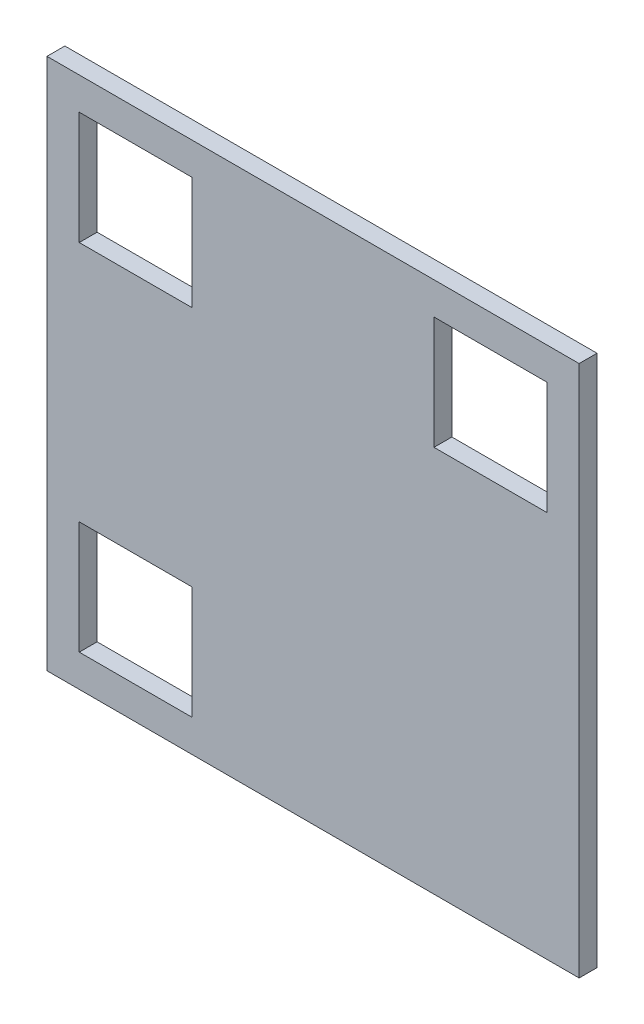
ISO-10303-21;
HEADER;
FILE_DESCRIPTION(('STEP AP214'),'2;1');
FILE_NAME('part.step','',(''),(''),'','','');
FILE_SCHEMA(('AUTOMOTIVE_DESIGN { 1 0 10303 214 1 1 1 1 }'));
ENDSEC;
DATA;
#1=APPLICATION_CONTEXT('core data for automotive mechanical design processes');
#2=APPLICATION_PROTOCOL_DEFINITION('international standard','automotive_design',2000,#1);
#3=PRODUCT_CONTEXT('',#1,'mechanical');
#4=PRODUCT('Part','Part','',(#3));
#5=PRODUCT_RELATED_PRODUCT_CATEGORY('part','',(#4));
#6=PRODUCT_DEFINITION_FORMATION('','',#4);
#7=PRODUCT_DEFINITION_CONTEXT('part definition',#1,'design');
#8=PRODUCT_DEFINITION('design','',#6,#7);
#9=PRODUCT_DEFINITION_SHAPE('','',#8);
#10=(LENGTH_UNIT() NAMED_UNIT(*) SI_UNIT(.MILLI.,.METRE.));
#11=(NAMED_UNIT(*) PLANE_ANGLE_UNIT() SI_UNIT($,.RADIAN.));
#12=(NAMED_UNIT(*) SI_UNIT($,.STERADIAN.) SOLID_ANGLE_UNIT());
#13=UNCERTAINTY_MEASURE_WITH_UNIT(LENGTH_MEASURE(1.E-05),#10,'distance_accuracy_value','');
#14=(GEOMETRIC_REPRESENTATION_CONTEXT(3) GLOBAL_UNCERTAINTY_ASSIGNED_CONTEXT((#13)) GLOBAL_UNIT_ASSIGNED_CONTEXT((#10,
#11,#12)) REPRESENTATION_CONTEXT('',''));
#15=CARTESIAN_POINT('',(0.,0.,0.));
#16=DIRECTION('',(0.,0.,1.));
#17=DIRECTION('',(1.,0.,0.));
#18=AXIS2_PLACEMENT_3D('',#15,#16,#17);
#19=CARTESIAN_POINT('',(2.38012320757309,12.2016563993689,0.15));
#20=DIRECTION('',(0.,-1.,0.));
#21=DIRECTION('',(0.,0.,-1.));
#22=AXIS2_PLACEMENT_3D('',#19,#20,#21);
#23=PLANE('',#22);
#24=DIRECTION('',(1.,0.,0.));
#25=VECTOR('',#24,1.);
#26=CARTESIAN_POINT('',(3.07432580978191,12.2016563993689,0.15));
#27=LINE('',#26,#25);
#28=CARTESIAN_POINT('',(2.38012320757309,12.2016563993689,0.15));
#29=VERTEX_POINT('',#28);
#30=CARTESIAN_POINT('',(3.07432580978191,12.2016563993689,0.15));
#31=VERTEX_POINT('',#30);
#32=EDGE_CURVE('E259',#29,#31,#27,.T.);
#33=ORIENTED_EDGE('',*,*,#32,.T.);
#34=DIRECTION('',(0.,0.,1.));
#35=VECTOR('',#34,1.);
#36=CARTESIAN_POINT('',(3.07432580978191,12.2016563993689,0.15));
#37=LINE('',#36,#35);
#38=CARTESIAN_POINT('',(3.07432580978191,12.2016563993689,0.26));
#39=VERTEX_POINT('',#38);
#40=EDGE_CURVE('E192',#31,#39,#37,.T.);
#41=ORIENTED_EDGE('',*,*,#40,.T.);
#42=DIRECTION('',(1.,0.,0.));
#43=VECTOR('',#42,1.);
#44=CARTESIAN_POINT('',(3.07432580978191,12.2016563993689,0.26));
#45=LINE('',#44,#43);
#46=CARTESIAN_POINT('',(2.38012320757309,12.2016563993689,0.26));
#47=VERTEX_POINT('',#46);
#48=EDGE_CURVE('E199',#47,#39,#45,.T.);
#49=ORIENTED_EDGE('',*,*,#48,.F.);
#50=DIRECTION('',(0.,0.,1.));
#51=VECTOR('',#50,1.);
#52=CARTESIAN_POINT('',(2.38012320757309,12.2016563993689,0.15));
#53=LINE('',#52,#51);
#54=EDGE_CURVE('E20',#29,#47,#53,.T.);
#55=ORIENTED_EDGE('',*,*,#54,.F.);
#56=EDGE_LOOP('',(#33,#41,#49,#55));
#57=FACE_BOUND('',#56,.T.);
#58=ADVANCED_FACE('F16',(#57),#23,.T.);
#59=CARTESIAN_POINT('',(0.198343600631091,10.0198767924269,0.15));
#60=DIRECTION('',(0.,-1.,0.));
#61=DIRECTION('',(0.,0.,-1.));
#62=AXIS2_PLACEMENT_3D('',#59,#60,#61);
#63=PLANE('',#62);
#64=DIRECTION('',(1.,0.,0.));
#65=VECTOR('',#64,1.);
#66=CARTESIAN_POINT('',(0.892546202839908,10.0198767924269,0.15));
#67=LINE('',#66,#65);
#68=CARTESIAN_POINT('',(0.198343600631091,10.0198767924269,0.15));
#69=VERTEX_POINT('',#68);
#70=CARTESIAN_POINT('',(0.892546202839908,10.0198767924269,0.15));
#71=VERTEX_POINT('',#70);
#72=EDGE_CURVE('E277',#69,#71,#67,.T.);
#73=ORIENTED_EDGE('',*,*,#72,.T.);
#74=DIRECTION('',(0.,0.,1.));
#75=VECTOR('',#74,1.);
#76=CARTESIAN_POINT('',(0.892546202839908,10.0198767924269,0.15));
#77=LINE('',#76,#75);
#78=CARTESIAN_POINT('',(0.892546202839908,10.0198767924269,0.26));
#79=VERTEX_POINT('',#78);
#80=EDGE_CURVE('E11',#71,#79,#77,.T.);
#81=ORIENTED_EDGE('',*,*,#80,.T.);
#82=DIRECTION('',(1.,0.,0.));
#83=VECTOR('',#82,1.);
#84=CARTESIAN_POINT('',(0.892546202839908,10.0198767924269,0.26));
#85=LINE('',#84,#83);
#86=CARTESIAN_POINT('',(0.198343600631091,10.0198767924269,0.26));
#87=VERTEX_POINT('',#86);
#88=EDGE_CURVE('E211',#87,#79,#85,.T.);
#89=ORIENTED_EDGE('',*,*,#88,.F.);
#90=DIRECTION('',(0.,0.,1.));
#91=VECTOR('',#90,1.);
#92=CARTESIAN_POINT('',(0.198343600631091,10.0198767924269,0.15));
#93=LINE('',#92,#91);
#94=EDGE_CURVE('E27',#69,#87,#93,.T.);
#95=ORIENTED_EDGE('',*,*,#94,.F.);
#96=EDGE_LOOP('',(#73,#81,#89,#95));
#97=FACE_BOUND('',#96,.T.);
#98=ADVANCED_FACE('F383',(#97),#63,.T.);
#99=CARTESIAN_POINT('',(0.892546202839908,10.0198767924269,0.15));
#100=DIRECTION('',(-1.,0.,0.));
#101=DIRECTION('',(0.,0.,1.));
#102=AXIS2_PLACEMENT_3D('',#99,#100,#101);
#103=PLANE('',#102);
#104=DIRECTION('',(0.,-1.,0.));
#105=VECTOR('',#104,1.);
#106=CARTESIAN_POINT('',(0.892546202839908,9.32567419021809,0.15));
#107=LINE('',#106,#105);
#108=CARTESIAN_POINT('',(0.892546202839908,9.32567419021809,0.15));
#109=VERTEX_POINT('',#108);
#110=EDGE_CURVE('E263',#71,#109,#107,.T.);
#111=ORIENTED_EDGE('',*,*,#110,.T.);
#112=DIRECTION('',(0.,0.,1.));
#113=VECTOR('',#112,1.);
#114=CARTESIAN_POINT('',(0.892546202839908,9.32567419021809,0.15));
#115=LINE('',#114,#113);
#116=CARTESIAN_POINT('',(0.892546202839908,9.32567419021809,0.26));
#117=VERTEX_POINT('',#116);
#118=EDGE_CURVE('E191',#109,#117,#115,.T.);
#119=ORIENTED_EDGE('',*,*,#118,.T.);
#120=DIRECTION('',(0.,-1.,0.));
#121=VECTOR('',#120,1.);
#122=CARTESIAN_POINT('',(0.892546202839908,9.32567419021809,0.26));
#123=LINE('',#122,#121);
#124=EDGE_CURVE('E203',#79,#117,#123,.T.);
#125=ORIENTED_EDGE('',*,*,#124,.F.);
#126=ORIENTED_EDGE('',*,*,#80,.F.);
#127=EDGE_LOOP('',(#111,#119,#125,#126));
#128=FACE_BOUND('',#127,.T.);
#129=ADVANCED_FACE('F389',(#128),#103,.T.);
#130=CARTESIAN_POINT('',(0.198343600631091,11.5074537971601,0.15));
#131=DIRECTION('',(1.,0.,0.));
#132=DIRECTION('',(0.,1.,0.));
#133=AXIS2_PLACEMENT_3D('',#130,#131,#132);
#134=PLANE('',#133);
#135=DIRECTION('',(0.,1.,0.));
#136=VECTOR('',#135,1.);
#137=CARTESIAN_POINT('',(0.198343600631091,12.2016563993689,0.15));
#138=LINE('',#137,#136);
#139=CARTESIAN_POINT('',(0.198343600631091,11.5074537971601,0.15));
#140=VERTEX_POINT('',#139);
#141=CARTESIAN_POINT('',(0.198343600631091,12.2016563993689,0.15));
#142=VERTEX_POINT('',#141);
#143=EDGE_CURVE('E269',#140,#142,#138,.T.);
#144=ORIENTED_EDGE('',*,*,#143,.T.);
#145=DIRECTION('',(0.,0.,1.));
#146=VECTOR('',#145,1.);
#147=CARTESIAN_POINT('',(0.198343600631091,12.2016563993689,0.15));
#148=LINE('',#147,#146);
#149=CARTESIAN_POINT('',(0.198343600631091,12.2016563993689,0.26));
#150=VERTEX_POINT('',#149);
#151=EDGE_CURVE('E244',#142,#150,#148,.T.);
#152=ORIENTED_EDGE('',*,*,#151,.T.);
#153=DIRECTION('',(0.,1.,0.));
#154=VECTOR('',#153,1.);
#155=CARTESIAN_POINT('',(0.198343600631091,12.2016563993689,0.26));
#156=LINE('',#155,#154);
#157=CARTESIAN_POINT('',(0.198343600631091,11.5074537971601,0.26));
#158=VERTEX_POINT('',#157);
#159=EDGE_CURVE('E253',#158,#150,#156,.T.);
#160=ORIENTED_EDGE('',*,*,#159,.F.);
#161=DIRECTION('',(0.,0.,1.));
#162=VECTOR('',#161,1.);
#163=CARTESIAN_POINT('',(0.198343600631091,11.5074537971601,0.15));
#164=LINE('',#163,#162);
#165=EDGE_CURVE('E216',#140,#158,#164,.T.);
#166=ORIENTED_EDGE('',*,*,#165,.F.);
#167=EDGE_LOOP('',(#144,#152,#160,#166));
#168=FACE_BOUND('',#167,.T.);
#169=ADVANCED_FACE('F751',(#168),#134,.T.);
#170=CARTESIAN_POINT('',(0.198343600631091,9.32567419021809,0.15));
#171=DIRECTION('',(1.,0.,0.));
#172=DIRECTION('',(0.,1.,0.));
#173=AXIS2_PLACEMENT_3D('',#170,#171,#172);
#174=PLANE('',#173);
#175=DIRECTION('',(0.,1.,0.));
#176=VECTOR('',#175,1.);
#177=CARTESIAN_POINT('',(0.198343600631091,10.0198767924269,0.15));
#178=LINE('',#177,#176);
#179=CARTESIAN_POINT('',(0.198343600631091,9.32567419021809,0.15));
#180=VERTEX_POINT('',#179);
#181=EDGE_CURVE('E274',#180,#69,#178,.T.);
#182=ORIENTED_EDGE('',*,*,#181,.T.);
#183=ORIENTED_EDGE('',*,*,#94,.T.);
#184=DIRECTION('',(0.,1.,0.));
#185=VECTOR('',#184,1.);
#186=CARTESIAN_POINT('',(0.198343600631091,10.0198767924269,0.26));
#187=LINE('',#186,#185);
#188=CARTESIAN_POINT('',(0.198343600631091,9.32567419021809,0.26));
#189=VERTEX_POINT('',#188);
#190=EDGE_CURVE('E194',#189,#87,#187,.T.);
#191=ORIENTED_EDGE('',*,*,#190,.F.);
#192=DIRECTION('',(0.,0.,1.));
#193=VECTOR('',#192,1.);
#194=CARTESIAN_POINT('',(0.198343600631091,9.32567419021809,0.15));
#195=LINE('',#194,#193);
#196=EDGE_CURVE('E182',#180,#189,#195,.T.);
#197=ORIENTED_EDGE('',*,*,#196,.F.);
#198=EDGE_LOOP('',(#182,#183,#191,#197));
#199=FACE_BOUND('',#198,.T.);
#200=ADVANCED_FACE('F195',(#199),#174,.T.);
#201=CARTESIAN_POINT('',(0.892546202839908,9.32567419021809,0.15));
#202=DIRECTION('',(0.,1.,0.));
#203=DIRECTION('',(1.,0.,0.));
#204=AXIS2_PLACEMENT_3D('',#201,#202,#203);
#205=PLANE('',#204);
#206=DIRECTION('',(-1.,0.,0.));
#207=VECTOR('',#206,1.);
#208=CARTESIAN_POINT('',(0.198343600631091,9.32567419021809,0.15));
#209=LINE('',#208,#207);
#210=EDGE_CURVE('E188',#109,#180,#209,.T.);
#211=ORIENTED_EDGE('',*,*,#210,.T.);
#212=ORIENTED_EDGE('',*,*,#196,.T.);
#213=DIRECTION('',(-1.,0.,0.));
#214=VECTOR('',#213,1.);
#215=CARTESIAN_POINT('',(0.198343600631091,9.32567419021809,0.26));
#216=LINE('',#215,#214);
#217=EDGE_CURVE('E185',#117,#189,#216,.T.);
#218=ORIENTED_EDGE('',*,*,#217,.F.);
#219=ORIENTED_EDGE('',*,*,#118,.F.);
#220=EDGE_LOOP('',(#211,#212,#218,#219));
#221=FACE_BOUND('',#220,.T.);
#222=ADVANCED_FACE('F183',(#221),#205,.T.);
#223=CARTESIAN_POINT('',(3.07432580978191,12.2016563993689,0.15));
#224=DIRECTION('',(-1.,0.,0.));
#225=DIRECTION('',(0.,0.,1.));
#226=AXIS2_PLACEMENT_3D('',#223,#224,#225);
#227=PLANE('',#226);
#228=DIRECTION('',(0.,-1.,0.));
#229=VECTOR('',#228,1.);
#230=CARTESIAN_POINT('',(3.07432580978191,11.5074537971601,0.15));
#231=LINE('',#230,#229);
#232=CARTESIAN_POINT('',(3.07432580978191,11.5074537971601,0.15));
#233=VERTEX_POINT('',#232);
#234=EDGE_CURVE('E251',#31,#233,#231,.T.);
#235=ORIENTED_EDGE('',*,*,#234,.T.);
#236=DIRECTION('',(0.,0.,1.));
#237=VECTOR('',#236,1.);
#238=CARTESIAN_POINT('',(3.07432580978191,11.5074537971601,0.15));
#239=LINE('',#238,#237);
#240=CARTESIAN_POINT('',(3.07432580978191,11.5074537971601,0.26));
#241=VERTEX_POINT('',#240);
#242=EDGE_CURVE('E41',#233,#241,#239,.T.);
#243=ORIENTED_EDGE('',*,*,#242,.T.);
#244=DIRECTION('',(0.,-1.,0.));
#245=VECTOR('',#244,1.);
#246=CARTESIAN_POINT('',(3.07432580978191,11.5074537971601,0.26));
#247=LINE('',#246,#245);
#248=EDGE_CURVE('E291',#39,#241,#247,.T.);
#249=ORIENTED_EDGE('',*,*,#248,.F.);
#250=ORIENTED_EDGE('',*,*,#40,.F.);
#251=EDGE_LOOP('',(#235,#243,#249,#250));
#252=FACE_BOUND('',#251,.T.);
#253=ADVANCED_FACE('F18',(#252),#227,.T.);
#254=CARTESIAN_POINT('',(0.892546202839908,12.2016563993689,0.15));
#255=DIRECTION('',(-1.,0.,0.));
#256=DIRECTION('',(0.,0.,1.));
#257=AXIS2_PLACEMENT_3D('',#254,#255,#256);
#258=PLANE('',#257);
#259=DIRECTION('',(0.,-1.,0.));
#260=VECTOR('',#259,1.);
#261=CARTESIAN_POINT('',(0.892546202839908,11.5074537971601,0.15));
#262=LINE('',#261,#260);
#263=CARTESIAN_POINT('',(0.892546202839908,12.2016563993689,0.15));
#264=VERTEX_POINT('',#263);
#265=CARTESIAN_POINT('',(0.892546202839908,11.5074537971601,0.15));
#266=VERTEX_POINT('',#265);
#267=EDGE_CURVE('E268',#264,#266,#262,.T.);
#268=ORIENTED_EDGE('',*,*,#267,.T.);
#269=DIRECTION('',(0.,0.,1.));
#270=VECTOR('',#269,1.);
#271=CARTESIAN_POINT('',(0.892546202839908,11.5074537971601,0.15));
#272=LINE('',#271,#270);
#273=CARTESIAN_POINT('',(0.892546202839908,11.5074537971601,0.26));
#274=VERTEX_POINT('',#273);
#275=EDGE_CURVE('E214',#266,#274,#272,.T.);
#276=ORIENTED_EDGE('',*,*,#275,.T.);
#277=DIRECTION('',(0.,-1.,0.));
#278=VECTOR('',#277,1.);
#279=CARTESIAN_POINT('',(0.892546202839908,11.5074537971601,0.26));
#280=LINE('',#279,#278);
#281=CARTESIAN_POINT('',(0.892546202839908,12.2016563993689,0.26));
#282=VERTEX_POINT('',#281);
#283=EDGE_CURVE('E228',#282,#274,#280,.T.);
#284=ORIENTED_EDGE('',*,*,#283,.F.);
#285=DIRECTION('',(0.,0.,1.));
#286=VECTOR('',#285,1.);
#287=CARTESIAN_POINT('',(0.892546202839908,12.2016563993689,0.15));
#288=LINE('',#287,#286);
#289=EDGE_CURVE('E247',#264,#282,#288,.T.);
#290=ORIENTED_EDGE('',*,*,#289,.F.);
#291=EDGE_LOOP('',(#268,#276,#284,#290));
#292=FACE_BOUND('',#291,.T.);
#293=ADVANCED_FACE('F774',(#292),#258,.T.);
#294=CARTESIAN_POINT('',(3.272669410413,9.127330589587,0.15));
#295=DIRECTION('',(1.,0.,0.));
#296=DIRECTION('',(0.,1.,0.));
#297=AXIS2_PLACEMENT_3D('',#294,#295,#296);
#298=PLANE('',#297);
#299=DIRECTION('',(0.,-1.,0.));
#300=VECTOR('',#299,1.);
#301=CARTESIAN_POINT('',(3.272669410413,12.4,0.15));
#302=LINE('',#301,#300);
#303=CARTESIAN_POINT('',(3.272669410413,12.4,0.15));
#304=VERTEX_POINT('',#303);
#305=CARTESIAN_POINT('',(3.272669410413,9.127330589587,0.15));
#306=VERTEX_POINT('',#305);
#307=EDGE_CURVE('E324',#304,#306,#302,.T.);
#308=ORIENTED_EDGE('',*,*,#307,.F.);
#309=DIRECTION('',(0.,0.,1.));
#310=VECTOR('',#309,1.);
#311=CARTESIAN_POINT('',(3.272669410413,12.4,0.15));
#312=LINE('',#311,#310);
#313=CARTESIAN_POINT('',(3.272669410413,12.4,0.26));
#314=VERTEX_POINT('',#313);
#315=EDGE_CURVE('E120',#304,#314,#312,.T.);
#316=ORIENTED_EDGE('',*,*,#315,.T.);
#317=DIRECTION('',(0.,1.,0.));
#318=VECTOR('',#317,1.);
#319=CARTESIAN_POINT('',(3.272669410413,12.4,0.26));
#320=LINE('',#319,#318);
#321=CARTESIAN_POINT('',(3.272669410413,9.127330589587,0.26));
#322=VERTEX_POINT('',#321);
#323=EDGE_CURVE('E239',#322,#314,#320,.T.);
#324=ORIENTED_EDGE('',*,*,#323,.F.);
#325=DIRECTION('',(0.,0.,1.));
#326=VECTOR('',#325,1.);
#327=CARTESIAN_POINT('',(3.272669410413,9.127330589587,0.15));
#328=LINE('',#327,#326);
#329=EDGE_CURVE('E219',#306,#322,#328,.T.);
#330=ORIENTED_EDGE('',*,*,#329,.F.);
#331=EDGE_LOOP('',(#308,#316,#324,#330));
#332=FACE_BOUND('',#331,.T.);
#333=ADVANCED_FACE('F360',(#332),#298,.T.);
#334=CARTESIAN_POINT('',(0.,12.4,0.15));
#335=DIRECTION('',(-1.,0.,0.));
#336=DIRECTION('',(0.,0.,1.));
#337=AXIS2_PLACEMENT_3D('',#334,#335,#336);
#338=PLANE('',#337);
#339=DIRECTION('',(0.,1.,0.));
#340=VECTOR('',#339,1.);
#341=CARTESIAN_POINT('',(0.,9.127330589587,0.15));
#342=LINE('',#341,#340);
#343=CARTESIAN_POINT('',(0.,9.127330589587,0.15));
#344=VERTEX_POINT('',#343);
#345=CARTESIAN_POINT('',(0.,12.4,0.15));
#346=VERTEX_POINT('',#345);
#347=EDGE_CURVE('E325',#344,#346,#342,.T.);
#348=ORIENTED_EDGE('',*,*,#347,.F.);
#349=DIRECTION('',(0.,0.,1.));
#350=VECTOR('',#349,1.);
#351=CARTESIAN_POINT('',(0.,9.127330589587,0.15));
#352=LINE('',#351,#350);
#353=CARTESIAN_POINT('',(0.,9.127330589587,0.26));
#354=VERTEX_POINT('',#353);
#355=EDGE_CURVE('E222',#344,#354,#352,.T.);
#356=ORIENTED_EDGE('',*,*,#355,.T.);
#357=DIRECTION('',(0.,-1.,0.));
#358=VECTOR('',#357,1.);
#359=CARTESIAN_POINT('',(0.,9.127330589587,0.26));
#360=LINE('',#359,#358);
#361=CARTESIAN_POINT('',(0.,12.4,0.26));
#362=VERTEX_POINT('',#361);
#363=EDGE_CURVE('E238',#362,#354,#360,.T.);
#364=ORIENTED_EDGE('',*,*,#363,.F.);
#365=DIRECTION('',(0.,0.,1.));
#366=VECTOR('',#365,1.);
#367=CARTESIAN_POINT('',(0.,12.4,0.15));
#368=LINE('',#367,#366);
#369=EDGE_CURVE('E130',#346,#362,#368,.T.);
#370=ORIENTED_EDGE('',*,*,#369,.F.);
#371=EDGE_LOOP('',(#348,#356,#364,#370));
#372=FACE_BOUND('',#371,.T.);
#373=ADVANCED_FACE('F365',(#372),#338,.T.);
#374=CARTESIAN_POINT('',(3.272669410413,12.4,0.15));
#375=DIRECTION('',(0.,1.,0.));
#376=DIRECTION('',(1.,0.,0.));
#377=AXIS2_PLACEMENT_3D('',#374,#375,#376);
#378=PLANE('',#377);
#379=DIRECTION('',(1.,0.,0.));
#380=VECTOR('',#379,1.);
#381=CARTESIAN_POINT('',(0.,12.4,0.15));
#382=LINE('',#381,#380);
#383=EDGE_CURVE('E320',#346,#304,#382,.T.);
#384=ORIENTED_EDGE('',*,*,#383,.F.);
#385=ORIENTED_EDGE('',*,*,#369,.T.);
#386=DIRECTION('',(-1.,0.,0.));
#387=VECTOR('',#386,1.);
#388=CARTESIAN_POINT('',(0.,12.4,0.26));
#389=LINE('',#388,#387);
#390=EDGE_CURVE('E234',#314,#362,#389,.T.);
#391=ORIENTED_EDGE('',*,*,#390,.F.);
#392=ORIENTED_EDGE('',*,*,#315,.F.);
#393=EDGE_LOOP('',(#384,#385,#391,#392));
#394=FACE_BOUND('',#393,.T.);
#395=ADVANCED_FACE('F367',(#394),#378,.T.);
#396=CARTESIAN_POINT('',(0.892546202839908,11.5074537971601,0.15));
#397=DIRECTION('',(0.,1.,0.));
#398=DIRECTION('',(1.,0.,0.));
#399=AXIS2_PLACEMENT_3D('',#396,#397,#398);
#400=PLANE('',#399);
#401=DIRECTION('',(-1.,0.,0.));
#402=VECTOR('',#401,1.);
#403=CARTESIAN_POINT('',(0.198343600631091,11.5074537971601,0.15));
#404=LINE('',#403,#402);
#405=EDGE_CURVE('E264',#266,#140,#404,.T.);
#406=ORIENTED_EDGE('',*,*,#405,.T.);
#407=ORIENTED_EDGE('',*,*,#165,.T.);
#408=DIRECTION('',(-1.,0.,0.));
#409=VECTOR('',#408,1.);
#410=CARTESIAN_POINT('',(0.198343600631091,11.5074537971601,0.26));
#411=LINE('',#410,#409);
#412=EDGE_CURVE('E232',#274,#158,#411,.T.);
#413=ORIENTED_EDGE('',*,*,#412,.F.);
#414=ORIENTED_EDGE('',*,*,#275,.F.);
#415=EDGE_LOOP('',(#406,#407,#413,#414));
#416=FACE_BOUND('',#415,.T.);
#417=ADVANCED_FACE('F369',(#416),#400,.T.);
#418=CARTESIAN_POINT('',(3.07432580978191,11.5074537971601,0.15));
#419=DIRECTION('',(0.,1.,0.));
#420=DIRECTION('',(1.,0.,0.));
#421=AXIS2_PLACEMENT_3D('',#418,#419,#420);
#422=PLANE('',#421);
#423=DIRECTION('',(-1.,0.,0.));
#424=VECTOR('',#423,1.);
#425=CARTESIAN_POINT('',(2.38012320757309,11.5074537971601,0.15));
#426=LINE('',#425,#424);
#427=CARTESIAN_POINT('',(2.38012320757309,11.5074537971601,0.15));
#428=VERTEX_POINT('',#427);
#429=EDGE_CURVE('E248',#233,#428,#426,.T.);
#430=ORIENTED_EDGE('',*,*,#429,.T.);
#431=DIRECTION('',(0.,0.,1.));
#432=VECTOR('',#431,1.);
#433=CARTESIAN_POINT('',(2.38012320757309,11.5074537971601,0.15));
#434=LINE('',#433,#432);
#435=CARTESIAN_POINT('',(2.38012320757309,11.5074537971601,0.26));
#436=VERTEX_POINT('',#435);
#437=EDGE_CURVE('E280',#428,#436,#434,.T.);
#438=ORIENTED_EDGE('',*,*,#437,.T.);
#439=DIRECTION('',(-1.,0.,0.));
#440=VECTOR('',#439,1.);
#441=CARTESIAN_POINT('',(2.38012320757309,11.5074537971601,0.26));
#442=LINE('',#441,#440);
#443=EDGE_CURVE('E243',#241,#436,#442,.T.);
#444=ORIENTED_EDGE('',*,*,#443,.F.);
#445=ORIENTED_EDGE('',*,*,#242,.F.);
#446=EDGE_LOOP('',(#430,#438,#444,#445));
#447=FACE_BOUND('',#446,.T.);
#448=ADVANCED_FACE('F376',(#447),#422,.T.);
#449=CARTESIAN_POINT('',(2.38012320757309,11.5074537971601,0.15));
#450=DIRECTION('',(1.,0.,0.));
#451=DIRECTION('',(0.,1.,0.));
#452=AXIS2_PLACEMENT_3D('',#449,#450,#451);
#453=PLANE('',#452);
#454=DIRECTION('',(0.,1.,0.));
#455=VECTOR('',#454,1.);
#456=CARTESIAN_POINT('',(2.38012320757309,12.2016563993689,0.15));
#457=LINE('',#456,#455);
#458=EDGE_CURVE('E252',#428,#29,#457,.T.);
#459=ORIENTED_EDGE('',*,*,#458,.T.);
#460=ORIENTED_EDGE('',*,*,#54,.T.);
#461=DIRECTION('',(0.,1.,0.));
#462=VECTOR('',#461,1.);
#463=CARTESIAN_POINT('',(2.38012320757309,12.2016563993689,0.26));
#464=LINE('',#463,#462);
#465=EDGE_CURVE('E227',#436,#47,#464,.T.);
#466=ORIENTED_EDGE('',*,*,#465,.F.);
#467=ORIENTED_EDGE('',*,*,#437,.F.);
#468=EDGE_LOOP('',(#459,#460,#466,#467));
#469=FACE_BOUND('',#468,.T.);
#470=ADVANCED_FACE('F407',(#469),#453,.T.);
#471=CARTESIAN_POINT('',(0.198343600631091,12.2016563993689,0.15));
#472=DIRECTION('',(0.,-1.,0.));
#473=DIRECTION('',(0.,0.,-1.));
#474=AXIS2_PLACEMENT_3D('',#471,#472,#473);
#475=PLANE('',#474);
#476=DIRECTION('',(1.,0.,0.));
#477=VECTOR('',#476,1.);
#478=CARTESIAN_POINT('',(0.892546202839908,12.2016563993689,0.15));
#479=LINE('',#478,#477);
#480=EDGE_CURVE('E336',#142,#264,#479,.T.);
#481=ORIENTED_EDGE('',*,*,#480,.T.);
#482=ORIENTED_EDGE('',*,*,#289,.T.);
#483=DIRECTION('',(1.,0.,0.));
#484=VECTOR('',#483,1.);
#485=CARTESIAN_POINT('',(0.892546202839908,12.2016563993689,0.26));
#486=LINE('',#485,#484);
#487=EDGE_CURVE('E233',#150,#282,#486,.T.);
#488=ORIENTED_EDGE('',*,*,#487,.F.);
#489=ORIENTED_EDGE('',*,*,#151,.F.);
#490=EDGE_LOOP('',(#481,#482,#488,#489));
#491=FACE_BOUND('',#490,.T.);
#492=ADVANCED_FACE('F768',(#491),#475,.T.);
#493=CARTESIAN_POINT('',(1.6363347052065,10.7636652947935,0.15));
#494=DIRECTION('',(0.,0.,1.));
#495=DIRECTION('',(1.,0.,0.));
#496=AXIS2_PLACEMENT_3D('',#493,#494,#495);
#497=PLANE('',#496);
#498=ORIENTED_EDGE('',*,*,#32,.F.);
#499=ORIENTED_EDGE('',*,*,#458,.F.);
#500=ORIENTED_EDGE('',*,*,#429,.F.);
#501=ORIENTED_EDGE('',*,*,#234,.F.);
#502=EDGE_LOOP('',(#498,#499,#500,#501));
#503=FACE_BOUND('',#502,.T.);
#504=ORIENTED_EDGE('',*,*,#72,.F.);
#505=ORIENTED_EDGE('',*,*,#181,.F.);
#506=ORIENTED_EDGE('',*,*,#210,.F.);
#507=ORIENTED_EDGE('',*,*,#110,.F.);
#508=EDGE_LOOP('',(#504,#505,#506,#507));
#509=FACE_BOUND('',#508,.T.);
#510=ORIENTED_EDGE('',*,*,#480,.F.);
#511=ORIENTED_EDGE('',*,*,#143,.F.);
#512=ORIENTED_EDGE('',*,*,#405,.F.);
#513=ORIENTED_EDGE('',*,*,#267,.F.);
#514=EDGE_LOOP('',(#510,#511,#512,#513));
#515=FACE_BOUND('',#514,.T.);
#516=DIRECTION('',(-1.,0.,0.));
#517=VECTOR('',#516,1.);
#518=CARTESIAN_POINT('',(3.272669410413,9.127330589587,0.15));
#519=LINE('',#518,#517);
#520=EDGE_CURVE('E223',#306,#344,#519,.T.);
#521=ORIENTED_EDGE('',*,*,#520,.T.);
#522=ORIENTED_EDGE('',*,*,#347,.T.);
#523=ORIENTED_EDGE('',*,*,#383,.T.);
#524=ORIENTED_EDGE('',*,*,#307,.T.);
#525=EDGE_LOOP('',(#521,#522,#523,#524));
#526=FACE_BOUND('',#525,.T.);
#527=ADVANCED_FACE('F356',(#503,#509,#515,#526),#497,.F.);
#528=CARTESIAN_POINT('',(0.,9.127330589587,0.15));
#529=DIRECTION('',(0.,-1.,0.));
#530=DIRECTION('',(0.,0.,-1.));
#531=AXIS2_PLACEMENT_3D('',#528,#529,#530);
#532=PLANE('',#531);
#533=ORIENTED_EDGE('',*,*,#520,.F.);
#534=ORIENTED_EDGE('',*,*,#329,.T.);
#535=DIRECTION('',(1.,0.,0.));
#536=VECTOR('',#535,1.);
#537=CARTESIAN_POINT('',(3.272669410413,9.127330589587,0.26));
#538=LINE('',#537,#536);
#539=EDGE_CURVE('E273',#354,#322,#538,.T.);
#540=ORIENTED_EDGE('',*,*,#539,.F.);
#541=ORIENTED_EDGE('',*,*,#355,.F.);
#542=EDGE_LOOP('',(#533,#534,#540,#541));
#543=FACE_BOUND('',#542,.T.);
#544=ADVANCED_FACE('F364',(#543),#532,.T.);
#545=CARTESIAN_POINT('',(1.6363347052065,10.7636652947935,0.26));
#546=DIRECTION('',(0.,0.,1.));
#547=DIRECTION('',(1.,0.,0.));
#548=AXIS2_PLACEMENT_3D('',#545,#546,#547);
#549=PLANE('',#548);
#550=ORIENTED_EDGE('',*,*,#48,.T.);
#551=ORIENTED_EDGE('',*,*,#248,.T.);
#552=ORIENTED_EDGE('',*,*,#443,.T.);
#553=ORIENTED_EDGE('',*,*,#465,.T.);
#554=EDGE_LOOP('',(#550,#551,#552,#553));
#555=FACE_BOUND('',#554,.T.);
#556=ORIENTED_EDGE('',*,*,#88,.T.);
#557=ORIENTED_EDGE('',*,*,#124,.T.);
#558=ORIENTED_EDGE('',*,*,#217,.T.);
#559=ORIENTED_EDGE('',*,*,#190,.T.);
#560=EDGE_LOOP('',(#556,#557,#558,#559));
#561=FACE_BOUND('',#560,.T.);
#562=ORIENTED_EDGE('',*,*,#487,.T.);
#563=ORIENTED_EDGE('',*,*,#283,.T.);
#564=ORIENTED_EDGE('',*,*,#412,.T.);
#565=ORIENTED_EDGE('',*,*,#159,.T.);
#566=EDGE_LOOP('',(#562,#563,#564,#565));
#567=FACE_BOUND('',#566,.T.);
#568=ORIENTED_EDGE('',*,*,#539,.T.);
#569=ORIENTED_EDGE('',*,*,#323,.T.);
#570=ORIENTED_EDGE('',*,*,#390,.T.);
#571=ORIENTED_EDGE('',*,*,#363,.T.);
#572=EDGE_LOOP('',(#568,#569,#570,#571));
#573=FACE_BOUND('',#572,.T.);
#574=ADVANCED_FACE('F201',(#555,#561,#567,#573),#549,.T.);
#575=CLOSED_SHELL('',(#58,#98,#129,#169,#200,#222,#253,#293,#333,#373,#395,#417,#448,#470,#492,
#527,#544,#574));
#576=MANIFOLD_SOLID_BREP('B1',#575);
#577=ADVANCED_BREP_SHAPE_REPRESENTATION('',(#18,#576),#14);
#578=SHAPE_DEFINITION_REPRESENTATION(#9,#577);
ENDSEC;
END-ISO-10303-21;
